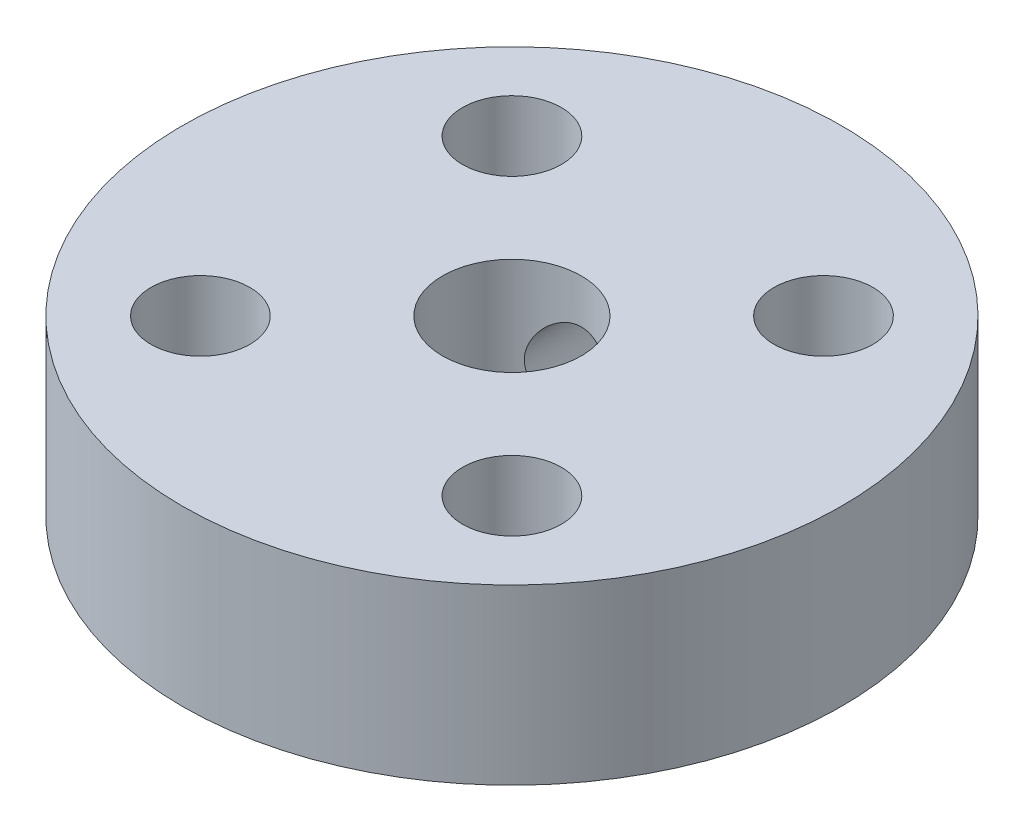
ISO-10303-21;
HEADER;
FILE_DESCRIPTION(('STEP AP214'),'2;1');
FILE_NAME('part.step','',(''),(''),'','','');
FILE_SCHEMA(('AUTOMOTIVE_DESIGN { 1 0 10303 214 1 1 1 1 }'));
ENDSEC;
DATA;
#1=APPLICATION_CONTEXT('core data for automotive mechanical design processes');
#2=APPLICATION_PROTOCOL_DEFINITION('international standard','automotive_design',2000,#1);
#3=PRODUCT_CONTEXT('',#1,'mechanical');
#4=PRODUCT('Part','Part','',(#3));
#5=PRODUCT_RELATED_PRODUCT_CATEGORY('part','',(#4));
#6=PRODUCT_DEFINITION_FORMATION('','',#4);
#7=PRODUCT_DEFINITION_CONTEXT('part definition',#1,'design');
#8=PRODUCT_DEFINITION('design','',#6,#7);
#9=PRODUCT_DEFINITION_SHAPE('','',#8);
#10=(LENGTH_UNIT() NAMED_UNIT(*) SI_UNIT(.MILLI.,.METRE.));
#11=(NAMED_UNIT(*) PLANE_ANGLE_UNIT() SI_UNIT($,.RADIAN.));
#12=(NAMED_UNIT(*) SI_UNIT($,.STERADIAN.) SOLID_ANGLE_UNIT());
#13=UNCERTAINTY_MEASURE_WITH_UNIT(LENGTH_MEASURE(1.E-05),#10,'distance_accuracy_value','');
#14=(GEOMETRIC_REPRESENTATION_CONTEXT(3) GLOBAL_UNCERTAINTY_ASSIGNED_CONTEXT((#13)) GLOBAL_UNIT_ASSIGNED_CONTEXT((#10,
#11,#12)) REPRESENTATION_CONTEXT('',''));
#15=CARTESIAN_POINT('',(0.,0.,0.));
#16=DIRECTION('',(0.,0.,1.));
#17=DIRECTION('',(1.,0.,0.));
#18=AXIS2_PLACEMENT_3D('',#15,#16,#17);
#19=CARTESIAN_POINT('',(0.,5.,0.));
#20=DIRECTION('',(0.,1.,0.));
#21=DIRECTION('',(0.,0.,1.));
#22=AXIS2_PLACEMENT_3D('',#19,#20,#21);
#23=PLANE('',#22);
#24=CARTESIAN_POINT('',(4.4901280605346,5.,4.49012806053455));
#25=DIRECTION('',(0.,1.,0.));
#26=DIRECTION('',(0.,0.,1.));
#27=AXIS2_PLACEMENT_3D('',#24,#25,#26);
#28=CIRCLE('',#27,1.425);
#29=CARTESIAN_POINT('',(4.4901280605346,5.,5.91512806053455));
#30=VERTEX_POINT('',#29);
#31=EDGE_CURVE('E61',#30,#30,#28,.T.);
#32=ORIENTED_EDGE('',*,*,#31,.F.);
#33=EDGE_LOOP('',(#32));
#34=FACE_BOUND('',#33,.T.);
#35=CARTESIAN_POINT('',(-4.4901280605346,5.,-4.49012806053455));
#36=DIRECTION('',(0.,1.,0.));
#37=DIRECTION('',(0.,0.,1.));
#38=AXIS2_PLACEMENT_3D('',#35,#36,#37);
#39=CIRCLE('',#38,1.425);
#40=CARTESIAN_POINT('',(-4.4901280605346,5.,-3.06512806053455));
#41=VERTEX_POINT('',#40);
#42=EDGE_CURVE('E49',#41,#41,#39,.T.);
#43=ORIENTED_EDGE('',*,*,#42,.F.);
#44=EDGE_LOOP('',(#43));
#45=FACE_BOUND('',#44,.T.);
#46=CARTESIAN_POINT('',(0.,5.,0.));
#47=DIRECTION('',(0.,1.,0.));
#48=DIRECTION('',(0.,0.,1.));
#49=AXIS2_PLACEMENT_3D('',#46,#47,#48);
#50=CIRCLE('',#49,9.5);
#51=CARTESIAN_POINT('',(0.,5.,9.5));
#52=VERTEX_POINT('',#51);
#53=EDGE_CURVE('E10',#52,#52,#50,.T.);
#54=ORIENTED_EDGE('',*,*,#53,.T.);
#55=EDGE_LOOP('',(#54));
#56=FACE_BOUND('',#55,.T.);
#57=CARTESIAN_POINT('',(0.,5.,0.));
#58=DIRECTION('',(0.,1.,0.));
#59=DIRECTION('',(0.,0.,1.));
#60=AXIS2_PLACEMENT_3D('',#57,#58,#59);
#61=CIRCLE('',#60,2.);
#62=CARTESIAN_POINT('',(0.,5.,2.));
#63=VERTEX_POINT('',#62);
#64=EDGE_CURVE('E44',#63,#63,#61,.T.);
#65=ORIENTED_EDGE('',*,*,#64,.F.);
#66=EDGE_LOOP('',(#65));
#67=FACE_BOUND('',#66,.T.);
#68=CARTESIAN_POINT('',(4.4901280605346,5.,-4.49012806053455));
#69=DIRECTION('',(0.,1.,0.));
#70=DIRECTION('',(0.,0.,-1.));
#71=AXIS2_PLACEMENT_3D('',#68,#69,#70);
#72=CIRCLE('',#71,1.425);
#73=CARTESIAN_POINT('',(4.4901280605346,5.,-5.91512806053455));
#74=VERTEX_POINT('',#73);
#75=EDGE_CURVE('E55',#74,#74,#72,.T.);
#76=ORIENTED_EDGE('',*,*,#75,.F.);
#77=EDGE_LOOP('',(#76));
#78=FACE_BOUND('',#77,.T.);
#79=CARTESIAN_POINT('',(-4.4901280605346,5.,4.49012806053455));
#80=DIRECTION('',(0.,1.,0.));
#81=DIRECTION('',(0.,0.,-1.));
#82=AXIS2_PLACEMENT_3D('',#79,#80,#81);
#83=CIRCLE('',#82,1.425);
#84=CARTESIAN_POINT('',(-4.4901280605346,5.,3.06512806053455));
#85=VERTEX_POINT('',#84);
#86=EDGE_CURVE('E67',#85,#85,#83,.T.);
#87=ORIENTED_EDGE('',*,*,#86,.F.);
#88=EDGE_LOOP('',(#87));
#89=FACE_BOUND('',#88,.T.);
#90=ADVANCED_FACE('F33',(#34,#45,#56,#67,#78,#89),#23,.T.);
#91=CARTESIAN_POINT('',(0.,0.,0.));
#92=DIRECTION('',(0.,1.,0.));
#93=DIRECTION('',(0.,0.,1.));
#94=AXIS2_PLACEMENT_3D('',#91,#92,#93);
#95=PLANE('',#94);
#96=CARTESIAN_POINT('',(0.,0.,0.));
#97=DIRECTION('',(0.,1.,0.));
#98=DIRECTION('',(0.,0.,1.));
#99=AXIS2_PLACEMENT_3D('',#96,#97,#98);
#100=CIRCLE('',#99,9.5);
#101=CARTESIAN_POINT('',(0.,0.,9.5));
#102=VERTEX_POINT('',#101);
#103=EDGE_CURVE('E37',#102,#102,#100,.T.);
#104=ORIENTED_EDGE('',*,*,#103,.F.);
#105=EDGE_LOOP('',(#104));
#106=FACE_BOUND('',#105,.T.);
#107=CARTESIAN_POINT('',(0.,0.,0.));
#108=DIRECTION('',(0.,1.,0.));
#109=DIRECTION('',(0.,0.,1.));
#110=AXIS2_PLACEMENT_3D('',#107,#108,#109);
#111=CIRCLE('',#110,2.);
#112=CARTESIAN_POINT('',(0.,0.,2.));
#113=VERTEX_POINT('',#112);
#114=EDGE_CURVE('E46',#113,#113,#111,.T.);
#115=ORIENTED_EDGE('',*,*,#114,.T.);
#116=EDGE_LOOP('',(#115));
#117=FACE_BOUND('',#116,.T.);
#118=CARTESIAN_POINT('',(-4.4901280605346,0.,-4.49012806053455));
#119=DIRECTION('',(0.,1.,0.));
#120=DIRECTION('',(0.,0.,1.));
#121=AXIS2_PLACEMENT_3D('',#118,#119,#120);
#122=CIRCLE('',#121,1.425);
#123=CARTESIAN_POINT('',(-4.4901280605346,0.,-3.06512806053455));
#124=VERTEX_POINT('',#123);
#125=EDGE_CURVE('E52',#124,#124,#122,.T.);
#126=ORIENTED_EDGE('',*,*,#125,.T.);
#127=EDGE_LOOP('',(#126));
#128=FACE_BOUND('',#127,.T.);
#129=CARTESIAN_POINT('',(4.4901280605346,0.,-4.49012806053455));
#130=DIRECTION('',(0.,1.,0.));
#131=DIRECTION('',(0.,0.,-1.));
#132=AXIS2_PLACEMENT_3D('',#129,#130,#131);
#133=CIRCLE('',#132,1.425);
#134=CARTESIAN_POINT('',(4.4901280605346,0.,-5.91512806053455));
#135=VERTEX_POINT('',#134);
#136=EDGE_CURVE('E58',#135,#135,#133,.T.);
#137=ORIENTED_EDGE('',*,*,#136,.T.);
#138=EDGE_LOOP('',(#137));
#139=FACE_BOUND('',#138,.T.);
#140=CARTESIAN_POINT('',(4.4901280605346,0.,4.49012806053455));
#141=DIRECTION('',(0.,1.,0.));
#142=DIRECTION('',(0.,0.,1.));
#143=AXIS2_PLACEMENT_3D('',#140,#141,#142);
#144=CIRCLE('',#143,1.425);
#145=CARTESIAN_POINT('',(4.4901280605346,0.,5.91512806053455));
#146=VERTEX_POINT('',#145);
#147=EDGE_CURVE('E64',#146,#146,#144,.T.);
#148=ORIENTED_EDGE('',*,*,#147,.T.);
#149=EDGE_LOOP('',(#148));
#150=FACE_BOUND('',#149,.T.);
#151=CARTESIAN_POINT('',(-4.4901280605346,0.,4.49012806053455));
#152=DIRECTION('',(0.,1.,0.));
#153=DIRECTION('',(0.,0.,-1.));
#154=AXIS2_PLACEMENT_3D('',#151,#152,#153);
#155=CIRCLE('',#154,1.425);
#156=CARTESIAN_POINT('',(-4.4901280605346,0.,3.06512806053455));
#157=VERTEX_POINT('',#156);
#158=EDGE_CURVE('E70',#157,#157,#155,.T.);
#159=ORIENTED_EDGE('',*,*,#158,.T.);
#160=EDGE_LOOP('',(#159));
#161=FACE_BOUND('',#160,.T.);
#162=ADVANCED_FACE('F115',(#106,#117,#128,#139,#150,#161),#95,.F.);
#163=CARTESIAN_POINT('',(0.,5.,0.));
#164=DIRECTION('',(0.,-1.,0.));
#165=DIRECTION('',(0.,0.,-1.));
#166=AXIS2_PLACEMENT_3D('',#163,#164,#165);
#167=CYLINDRICAL_SURFACE('',#166,9.5);
#168=CARTESIAN_POINT('',(-1.225,2.5,-9.42068866909421));
#169=CARTESIAN_POINT('',(-1.22499709865934,2.56850119476712,-9.42068968008304));
#170=CARTESIAN_POINT('',(-1.21923479283014,2.6370447592432,-9.42144388417472));
#171=CARTESIAN_POINT('',(-1.19633965153308,2.77222302420468,-9.42437793764247));
#172=CARTESIAN_POINT('',(-1.1791950498231,2.83885567488312,-9.42655926224454));
#173=CARTESIAN_POINT('',(-1.13405027100076,2.96823545388233,-9.43209647166226));
#174=CARTESIAN_POINT('',(-1.10605760197875,3.03098523483047,-9.43545154395581));
#175=CARTESIAN_POINT('',(-1.04002762035908,3.15088540878797,-9.44295724017658));
#176=CARTESIAN_POINT('',(-1.0019919758161,3.20803672949583,-9.44710773195988));
#177=CARTESIAN_POINT('',(-0.91671354986486,3.31546884468767,-9.45576424826968));
#178=CARTESIAN_POINT('',(-0.869422924253469,3.36571152249943,-9.4602720445942));
#179=CARTESIAN_POINT('',(-0.767079996828368,3.45757073467239,-9.46911934002949));
#180=CARTESIAN_POINT('',(-0.712027303364591,3.49918683350105,-9.47345883063398));
#181=CARTESIAN_POINT('',(-0.595482661690747,3.57274891533215,-9.48149877143937));
#182=CARTESIAN_POINT('',(-0.533968705418879,3.60466030435623,-9.48519691579327));
#183=CARTESIAN_POINT('',(-0.406399064978234,3.65768548186576,-9.49151798583682));
#184=CARTESIAN_POINT('',(-0.340343559854838,3.67879969574093,-9.49414095388573));
#185=CARTESIAN_POINT('',(-0.205956211650491,3.70951701440922,-9.4980036518478));
#186=CARTESIAN_POINT('',(-0.13763909495843,3.71918357285662,-9.49925100404057));
#187=CARTESIAN_POINT('',(-0.000341748230942986,3.72692788963726,-9.50024797059137));
#188=CARTESIAN_POINT('',(0.068638454020692,3.72500613143482,-9.4999976474324));
#189=CARTESIAN_POINT('',(0.204871983670085,3.70967910541163,-9.49803362376351));
#190=CARTESIAN_POINT('',(0.272133132166906,3.69634208362378,-9.4963286202373));
#191=CARTESIAN_POINT('',(0.403454548429558,3.65866986663005,-9.49165656214839));
#192=CARTESIAN_POINT('',(0.467514752040359,3.63433445108667,-9.48868948230183));
#193=CARTESIAN_POINT('',(0.590826431677813,3.57528406300864,-9.48181167065156));
#194=CARTESIAN_POINT('',(0.650063666318719,3.54053967437055,-9.47789827064131));
#195=CARTESIAN_POINT('',(0.761892536540219,3.46167901529738,-9.46956540351521));
#196=CARTESIAN_POINT('',(0.814483847675381,3.41756228759844,-9.46514591171268));
#197=CARTESIAN_POINT('',(0.911929141022382,3.32082732235275,-9.45625727078792));
#198=CARTESIAN_POINT('',(0.956724072172464,3.26814959104126,-9.45178799427617));
#199=CARTESIAN_POINT('',(1.03684578034223,3.15599199010327,-9.44333516613547));
#200=CARTESIAN_POINT('',(1.07217252414367,3.09651209661306,-9.43935161621067));
#201=CARTESIAN_POINT('',(1.13235910536284,2.97238466886437,-9.43232134352188));
#202=CARTESIAN_POINT('',(1.15721401733789,2.90773471983353,-9.42927506178475));
#203=CARTESIAN_POINT('',(1.19569800568057,2.77513057580906,-9.42447270941835));
#204=CARTESIAN_POINT('',(1.20932765905175,2.70717655084254,-9.42271657247324));
#205=CARTESIAN_POINT('',(1.22489562531942,2.57041531713493,-9.42070554215065));
#206=CARTESIAN_POINT('',(1.22691712952424,2.50161772951241,-9.42043996678131));
#207=CARTESIAN_POINT('',(1.21943109855477,2.36466485582994,-9.42141186251064));
#208=CARTESIAN_POINT('',(1.20992382530383,2.29650955521326,-9.42264929946224));
#209=CARTESIAN_POINT('',(1.17972023734672,2.16302646631099,-9.42647803518881));
#210=CARTESIAN_POINT('',(1.15906437506381,2.09768937217438,-9.42906443813355));
#211=CARTESIAN_POINT('',(1.10719165791381,1.97140591034599,-9.43529570470319));
#212=CARTESIAN_POINT('',(1.07597440955179,1.91045970635213,-9.43894060776486));
#213=CARTESIAN_POINT('',(1.00366120554461,1.79431218431,-9.44690371262752));
#214=CARTESIAN_POINT('',(0.962510797466786,1.73914502353837,-9.45122557794094));
#215=CARTESIAN_POINT('',(0.871576170013216,1.63647047895179,-9.46004421015653));
#216=CARTESIAN_POINT('',(0.821791592798144,1.5889634127636,-9.46454098430172));
#217=CARTESIAN_POINT('',(0.714637979391556,1.5026644172879,-9.47323565943418));
#218=CARTESIAN_POINT('',(0.657224677630269,1.46392722209951,-9.4774315774273));
#219=CARTESIAN_POINT('',(0.536658052416349,1.39664668034297,-9.48502195656067));
#220=CARTESIAN_POINT('',(0.473504850999519,1.36810311711194,-9.48841643473478));
#221=CARTESIAN_POINT('',(0.343431378376751,1.32211004489426,-9.4940126841113));
#222=CARTESIAN_POINT('',(0.276522354598678,1.30462915415568,-9.49621782647846));
#223=CARTESIAN_POINT('',(0.140688479557643,1.28115562761889,-9.49920096649316));
#224=CARTESIAN_POINT('',(0.071763725489932,1.2751624388265,-9.49997903283711));
#225=CARTESIAN_POINT('',(-0.0656111858377317,1.2748452363498,-9.50001997731717));
#226=CARTESIAN_POINT('',(-0.134061160436176,1.28043692223984,-9.49929380147855));
#227=CARTESIAN_POINT('',(-0.269039738514282,1.30295188328429,-9.49642965580152));
#228=CARTESIAN_POINT('',(-0.33556834394316,1.31987514694247,-9.49429168739544));
#229=CARTESIAN_POINT('',(-0.46480284180257,1.36454588323132,-9.48884308963059));
#230=CARTESIAN_POINT('',(-0.527510243432013,1.39228905004048,-9.4855329267992));
#231=CARTESIAN_POINT('',(-0.647392805316869,1.457803317978,-9.47810603907808));
#232=CARTESIAN_POINT('',(-0.704567882761629,1.49557456918017,-9.47398930211794));
#233=CARTESIAN_POINT('',(-0.812193090166347,1.58038375295096,-9.46537278747054));
#234=CARTESIAN_POINT('',(-0.862593639257869,1.62748435840921,-9.46087054299941));
#235=CARTESIAN_POINT('',(-0.954808074519508,1.72948459783111,-9.45201001533674));
#236=CARTESIAN_POINT('',(-0.996619927570788,1.78438607322779,-9.44765176643629));
#237=CARTESIAN_POINT('',(-1.07061830989047,1.90068953273254,-9.43955358876871));
#238=CARTESIAN_POINT('',(-1.10276459219988,1.9621172947508,-9.43581627364353));
#239=CARTESIAN_POINT('',(-1.156238941261,2.08951407845013,-9.42941372919864));
#240=CARTESIAN_POINT('',(-1.17757869584358,2.15547810580789,-9.42674734226222));
#241=CARTESIAN_POINT('',(-1.20376377300374,2.26814775002131,-9.42343143541802));
#242=CARTESIAN_POINT('',(-1.21171580127918,2.31414465794692,-9.42240806793997));
#243=CARTESIAN_POINT('',(-1.222334880445,2.40675450221404,-9.42103634345504));
#244=CARTESIAN_POINT('',(-1.22500197510368,2.45336743345059,-9.42068798085798));
#245=CARTESIAN_POINT('',(-1.225,2.5,-9.42068866909421));
#246=B_SPLINE_CURVE_WITH_KNOTS('',3,(#168,#169,#170,#171,#172,#173,#174,#175,#176,#177,#178,
#179,#180,#181,#182,#183,#184,#185,#186,#187,#188,#189,#190,#191,#192,#193,#194,#195,#196,#197,
#198,#199,#200,#201,#202,#203,#204,#205,#206,#207,#208,#209,#210,#211,#212,#213,#214,#215,#216,
#217,#218,#219,#220,#221,#222,#223,#224,#225,#226,#227,#228,#229,#230,#231,#232,#233,#234,#235,
#236,#237,#238,#239,#240,#241,#242,#243,#244,#245),.UNSPECIFIED.,.T.,.F.,(4,2,2,2,2,2,2,2,2,2,2,
2,2,2,2,2,2,2,2,2,2,2,2,2,2,2,2,2,2,2,2,2,2,2,2,2,2,2,4),(0.,0.205333215114874,
0.410879020910187,0.616282819086175,0.821652522836657,1.0281133640807,1.23458462643422,
1.44178348683321,1.64897418333223,1.85501097753251,2.06103917594161,2.26584417243452,
2.4706532720923,2.67604671827297,2.88145018762689,3.08834744940733,3.29524543705798,
3.50224063115709,3.70922518457355,3.91472448691588,4.12021912058811,4.32497308534553,
4.52973467964317,4.7356453165044,4.94156448928137,5.14873542685684,5.35590196080826,
5.56247815461618,5.76904440402421,5.97411279980967,6.17918098754738,6.38416765075679,
6.58915738183673,6.79557399358082,7.00203941216271,7.20935300158032,7.41644188893379,
7.5562247664638,7.6960064863477),.UNSPECIFIED.);
#247=CARTESIAN_POINT('',(-1.225,2.5,-9.42068866909421));
#248=VERTEX_POINT('',#247);
#249=EDGE_CURVE('E82',#248,#248,#246,.T.);
#250=ORIENTED_EDGE('',*,*,#249,.F.);
#251=EDGE_LOOP('',(#250));
#252=FACE_BOUND('',#251,.T.);
#253=ORIENTED_EDGE('',*,*,#53,.F.);
#254=EDGE_LOOP('',(#253));
#255=FACE_BOUND('',#254,.T.);
#256=ORIENTED_EDGE('',*,*,#103,.T.);
#257=EDGE_LOOP('',(#256));
#258=FACE_BOUND('',#257,.T.);
#259=ADVANCED_FACE('F35',(#252,#255,#258),#167,.T.);
#260=CARTESIAN_POINT('',(0.,5.,0.));
#261=DIRECTION('',(0.,-1.,0.));
#262=DIRECTION('',(0.,0.,-1.));
#263=AXIS2_PLACEMENT_3D('',#260,#261,#262);
#264=CYLINDRICAL_SURFACE('',#263,2.);
#265=CARTESIAN_POINT('',(-1.225,2.5,-1.58094117537624));
#266=CARTESIAN_POINT('',(-1.22499122147415,2.56120620332825,-1.5809539788787));
#267=CARTESIAN_POINT('',(-1.2203723876472,2.62249395363184,-1.5845609560338));
#268=CARTESIAN_POINT('',(-1.20220361919125,2.74305443233471,-1.59838193059175));
#269=CARTESIAN_POINT('',(-1.1886273103594,2.80232066500172,-1.60861543735262));
#270=CARTESIAN_POINT('',(-1.15348662694621,2.91670820721222,-1.63399191134482));
#271=CARTESIAN_POINT('',(-1.13198912026802,2.97185969488396,-1.64909365283668));
#272=CARTESIAN_POINT('',(-1.08181120544,3.07770598551229,-1.68243574341253));
#273=CARTESIAN_POINT('',(-1.05313114331982,3.12840100300664,-1.70067594128375));
#274=CARTESIAN_POINT('',(-0.98511491413823,3.23105034980388,-1.741064189181));
#275=CARTESIAN_POINT('',(-0.944883972757908,3.28233284791586,-1.76341343791531));
#276=CARTESIAN_POINT('',(-0.856736512751712,3.37798749191381,-1.80788375439534));
#277=CARTESIAN_POINT('',(-0.808813529713482,3.422353763014,-1.83000461341121));
#278=CARTESIAN_POINT('',(-0.700014852753092,3.50792907961455,-1.87451642871692));
#279=CARTESIAN_POINT('',(-0.638285036903312,3.54819951239879,-1.89664993622898));
#280=CARTESIAN_POINT('',(-0.507312576535772,3.61746577489249,-1.93579134016997));
#281=CARTESIAN_POINT('',(-0.43807720031144,3.64647238976909,-1.95280413617964));
#282=CARTESIAN_POINT('',(-0.30126228630364,3.68932135994803,-1.97828081943678));
#283=CARTESIAN_POINT('',(-0.234191994672972,3.70437644408653,-1.98742197507357));
#284=CARTESIAN_POINT('',(-0.0979215837997548,3.72300910326114,-1.99876675643667));
#285=CARTESIAN_POINT('',(-0.0287236524841506,3.72659809538545,-2.00097728313089));
#286=CARTESIAN_POINT('',(0.100194961644733,3.72237483164824,-1.99839356162764));
#287=CARTESIAN_POINT('',(0.159986220722439,3.71597419490876,-1.99446650184842));
#288=CARTESIAN_POINT('',(0.277455220580947,3.69465746203092,-1.98154217338069));
#289=CARTESIAN_POINT('',(0.335132801363347,3.67974072266307,-1.97254452170611));
#290=CARTESIAN_POINT('',(0.447195549813713,3.64199622308899,-1.95020482645198));
#291=CARTESIAN_POINT('',(0.501565681914992,3.61913510840009,-1.93684448058774));
#292=CARTESIAN_POINT('',(0.605753034571028,3.56635002352211,-1.90683152844591));
#293=CARTESIAN_POINT('',(0.655569142925062,3.53642433435497,-1.89017812104894));
#294=CARTESIAN_POINT('',(0.755753589264726,3.46625334650885,-1.85257563753712));
#295=CARTESIAN_POINT('',(0.805447607065019,3.42519440982087,-1.83135035457286));
#296=CARTESIAN_POINT('',(0.897671002895369,3.33602307160525,-1.78795717916508));
#297=CARTESIAN_POINT('',(0.940190116448492,3.28790074598303,-1.7657879921639));
#298=CARTESIAN_POINT('',(1.02216647440352,3.17897343231021,-1.71978015012407));
#299=CARTESIAN_POINT('',(1.06060111057787,3.1173363511981,-1.69607231164618));
#300=CARTESIAN_POINT('',(1.12638646804965,2.987012058473,-1.65311942761175));
#301=CARTESIAN_POINT('',(1.15375769840297,2.91833819060353,-1.63386615290721));
#302=CARTESIAN_POINT('',(1.19053390778286,2.79381201306798,-1.60717373797391));
#303=CARTESIAN_POINT('',(1.20274243278461,2.73916667198975,-1.5979729601045));
#304=CARTESIAN_POINT('',(1.21957315180789,2.62810329693352,-1.58516812947171));
#305=CARTESIAN_POINT('',(1.22420491990948,2.57168759207479,-1.58155701385547));
#306=CARTESIAN_POINT('',(1.22560791264349,2.45859601983087,-1.58047035593654));
#307=CARTESIAN_POINT('',(1.22236489925028,2.40191986640861,-1.58300592715822));
#308=CARTESIAN_POINT('',(1.2081988053153,2.29008648754689,-1.59384157802492));
#309=CARTESIAN_POINT('',(1.19726948777725,2.23493053345897,-1.6021463389706));
#310=CARTESIAN_POINT('',(1.1684393803391,2.12794961656836,-1.62328722211386));
#311=CARTESIAN_POINT('',(1.1505984988789,2.07610037176594,-1.63608431828205));
#312=CARTESIAN_POINT('',(1.10859533903588,1.97598443919135,-1.66483119213558));
#313=CARTESIAN_POINT('',(1.08443075420732,1.92771906682826,-1.68078211959852));
#314=CARTESIAN_POINT('',(1.02530036073911,1.82663503593026,-1.71760994257343));
#315=CARTESIAN_POINT('',(0.989162164500907,1.77463453463172,-1.7388515832906));
#316=CARTESIAN_POINT('',(0.909439015008524,1.67687795496683,-1.78184629839693));
#317=CARTESIAN_POINT('',(0.865846598978016,1.63112821792858,-1.80359986629392));
#318=CARTESIAN_POINT('',(0.764950400226492,1.54046154679785,-1.84887267283765));
#319=CARTESIAN_POINT('',(0.706575309313424,1.4966232288238,-1.87219186233137));
#320=CARTESIAN_POINT('',(0.581832515257148,1.41950890359171,-1.91462808186235));
#321=CARTESIAN_POINT('',(0.515469451634931,1.38622680558694,-1.93374753310689));
#322=CARTESIAN_POINT('',(0.381085180966447,1.33370407194699,-1.96448449214685));
#323=CARTESIAN_POINT('',(0.313471995061788,1.31367295087942,-1.97651834447809));
#324=CARTESIAN_POINT('',(0.17497973581579,1.28551157388461,-1.99354651128063));
#325=CARTESIAN_POINT('',(0.104104873389868,1.27736639414246,-1.99854965311692));
#326=CARTESIAN_POINT('',(-0.0280642880117464,1.27379412073637,-2.00073945831122));
#327=CARTESIAN_POINT('',(-0.089304860170021,1.27674020931281,-1.99892601283891));
#328=CARTESIAN_POINT('',(-0.210257875910212,1.29164259892076,-1.98984098555084));
#329=CARTESIAN_POINT('',(-0.269970340979631,1.30359877318475,-1.98256948052733));
#330=CARTESIAN_POINT('',(-0.384771442844798,1.3355083394685,-1.96348108234412));
#331=CARTESIAN_POINT('',(-0.439938297166457,1.3552546317581,-1.95178219533932));
#332=CARTESIAN_POINT('',(-0.546157075968082,1.40195337693111,-1.92476471093372));
#333=CARTESIAN_POINT('',(-0.597208211118611,1.42890720784708,-1.90944542140163));
#334=CARTESIAN_POINT('',(-0.699630357754697,1.49245207814085,-1.87449956080282));
#335=CARTESIAN_POINT('',(-0.750455353872598,1.52976414935293,-1.85458791602334));
#336=CARTESIAN_POINT('',(-0.845507756854067,1.61136475197523,-1.81323183989662));
#337=CARTESIAN_POINT('',(-0.889727427740392,1.65566134062885,-1.79178565412615));
#338=CARTESIAN_POINT('',(-0.976511453519425,1.75697438542684,-1.74617849039532));
#339=CARTESIAN_POINT('',(-1.0180334653938,1.81490140101793,-1.72204481735953));
#340=CARTESIAN_POINT('',(-1.09081914521455,1.9380057057893,-1.67688746505844));
#341=CARTESIAN_POINT('',(-1.12209009927782,2.00317780109014,-1.65586158273938));
#342=CARTESIAN_POINT('',(-1.167354027814,2.12435054220383,-1.62415246344603));
#343=CARTESIAN_POINT('',(-1.183643761339,2.17916235887018,-1.61220874933955));
#344=CARTESIAN_POINT('',(-1.20844465733026,2.29129714241417,-1.59370967295701));
#345=CARTESIAN_POINT('',(-1.21698134319469,2.34861121379395,-1.5871366373781));
#346=CARTESIAN_POINT('',(-1.22380579588288,2.43748436140981,-1.58186613312067));
#347=CARTESIAN_POINT('',(-1.22500448469233,2.46873153927509,-1.58093463444097));
#348=CARTESIAN_POINT('',(-1.225,2.5,-1.58094117537624));
#349=B_SPLINE_CURVE_WITH_KNOTS('',3,(#265,#266,#267,#268,#269,#270,#271,#272,#273,#274,#275,
#276,#277,#278,#279,#280,#281,#282,#283,#284,#285,#286,#287,#288,#289,#290,#291,#292,#293,#294,
#295,#296,#297,#298,#299,#300,#301,#302,#303,#304,#305,#306,#307,#308,#309,#310,#311,#312,#313,
#314,#315,#316,#317,#318,#319,#320,#321,#322,#323,#324,#325,#326,#327,#328,#329,#330,#331,#332,
#333,#334,#335,#336,#337,#338,#339,#340,#341,#342,#343,#344,#345,#346,#347,#348),.UNSPECIFIED.,
.T.,.F.,(4,2,2,2,2,2,2,2,2,2,2,2,2,2,2,2,2,2,2,2,2,2,2,2,2,2,2,2,2,2,2,2,2,2,2,2,2,2,2,2,2,4),
(0.,0.183499860269888,0.367542439353278,0.550065718653171,0.732580206329855,0.938494453469703,
1.14458266639952,1.37419760206463,1.60359213484091,1.81037968411444,2.01696126532925,
2.19688233397099,2.37681699402352,2.55751642440815,2.73825986863993,2.9410575837934,
3.1441430075896,3.37224886517659,3.59992990498902,3.76944018279764,3.93873609948115,
4.10833834007184,4.27807836221025,4.44637888406714,4.61474087597189,4.81435882116662,
5.01417779619388,5.24291337994946,5.47151674633794,5.68482489545861,5.89786498683916,
6.08095834841906,6.26404913401232,6.44256911164552,6.62112324552369,6.81871110721249,
7.01652859401732,7.24123961477272,7.46579057021953,7.64034441120873,7.81432150753662,
7.9080662239521),.UNSPECIFIED.);
#350=CARTESIAN_POINT('',(-1.225,2.5,-1.58094117537624));
#351=VERTEX_POINT('',#350);
#352=EDGE_CURVE('E73',#351,#351,#349,.T.);
#353=ORIENTED_EDGE('',*,*,#352,.T.);
#354=EDGE_LOOP('',(#353));
#355=FACE_BOUND('',#354,.T.);
#356=ORIENTED_EDGE('',*,*,#64,.T.);
#357=EDGE_LOOP('',(#356));
#358=FACE_BOUND('',#357,.T.);
#359=ORIENTED_EDGE('',*,*,#114,.F.);
#360=EDGE_LOOP('',(#359));
#361=FACE_BOUND('',#360,.T.);
#362=ADVANCED_FACE('F109',(#355,#358,#361),#264,.F.);
#363=CARTESIAN_POINT('',(-4.4901280605346,5.,-4.49012806053455));
#364=DIRECTION('',(0.,-1.,0.));
#365=DIRECTION('',(0.,0.,-1.));
#366=AXIS2_PLACEMENT_3D('',#363,#364,#365);
#367=CYLINDRICAL_SURFACE('',#366,1.425);
#368=ORIENTED_EDGE('',*,*,#42,.T.);
#369=EDGE_LOOP('',(#368));
#370=FACE_BOUND('',#369,.T.);
#371=ORIENTED_EDGE('',*,*,#125,.F.);
#372=EDGE_LOOP('',(#371));
#373=FACE_BOUND('',#372,.T.);
#374=ADVANCED_FACE('F105',(#370,#373),#367,.F.);
#375=CARTESIAN_POINT('',(4.4901280605346,5.,-4.49012806053455));
#376=DIRECTION('',(0.,-1.,0.));
#377=DIRECTION('',(0.,0.,-1.));
#378=AXIS2_PLACEMENT_3D('',#375,#376,#377);
#379=CYLINDRICAL_SURFACE('',#378,1.425);
#380=ORIENTED_EDGE('',*,*,#75,.T.);
#381=EDGE_LOOP('',(#380));
#382=FACE_BOUND('',#381,.T.);
#383=ORIENTED_EDGE('',*,*,#136,.F.);
#384=EDGE_LOOP('',(#383));
#385=FACE_BOUND('',#384,.T.);
#386=ADVANCED_FACE('F101',(#382,#385),#379,.F.);
#387=CARTESIAN_POINT('',(4.4901280605346,5.,4.49012806053455));
#388=DIRECTION('',(0.,-1.,0.));
#389=DIRECTION('',(0.,0.,-1.));
#390=AXIS2_PLACEMENT_3D('',#387,#388,#389);
#391=CYLINDRICAL_SURFACE('',#390,1.425);
#392=ORIENTED_EDGE('',*,*,#31,.T.);
#393=EDGE_LOOP('',(#392));
#394=FACE_BOUND('',#393,.T.);
#395=ORIENTED_EDGE('',*,*,#147,.F.);
#396=EDGE_LOOP('',(#395));
#397=FACE_BOUND('',#396,.T.);
#398=ADVANCED_FACE('F97',(#394,#397),#391,.F.);
#399=CARTESIAN_POINT('',(-4.4901280605346,5.,4.49012806053455));
#400=DIRECTION('',(0.,-1.,0.));
#401=DIRECTION('',(0.,0.,-1.));
#402=AXIS2_PLACEMENT_3D('',#399,#400,#401);
#403=CYLINDRICAL_SURFACE('',#402,1.425);
#404=ORIENTED_EDGE('',*,*,#86,.T.);
#405=EDGE_LOOP('',(#404));
#406=FACE_BOUND('',#405,.T.);
#407=ORIENTED_EDGE('',*,*,#158,.F.);
#408=EDGE_LOOP('',(#407));
#409=FACE_BOUND('',#408,.T.);
#410=ADVANCED_FACE('F92',(#406,#409),#403,.F.);
#411=CARTESIAN_POINT('',(0.,2.5,9.501));
#412=DIRECTION('',(0.,0.,-1.));
#413=DIRECTION('',(-1.,0.,0.));
#414=AXIS2_PLACEMENT_3D('',#411,#412,#413);
#415=CYLINDRICAL_SURFACE('',#414,1.225);
#416=ORIENTED_EDGE('',*,*,#352,.F.);
#417=EDGE_LOOP('',(#416));
#418=FACE_BOUND('',#417,.T.);
#419=ORIENTED_EDGE('',*,*,#249,.T.);
#420=EDGE_LOOP('',(#419));
#421=FACE_BOUND('',#420,.T.);
#422=ADVANCED_FACE('F86',(#418,#421),#415,.F.);
#423=CLOSED_SHELL('',(#90,#162,#259,#362,#374,#386,#398,#410,#422));
#424=MANIFOLD_SOLID_BREP('B2',#423);
#425=ADVANCED_BREP_SHAPE_REPRESENTATION('',(#18,#424),#14);
#426=SHAPE_DEFINITION_REPRESENTATION(#9,#425);
ENDSEC;
END-ISO-10303-21;
